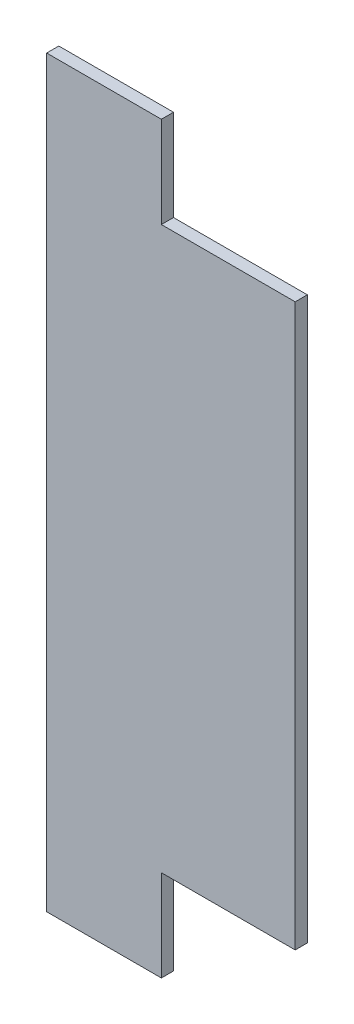
ISO-10303-21;
HEADER;
FILE_DESCRIPTION(('STEP AP214'),'2;1');
FILE_NAME('part.step','',(''),(''),'','','');
FILE_SCHEMA(('AUTOMOTIVE_DESIGN { 1 0 10303 214 1 1 1 1 }'));
ENDSEC;
DATA;
#1=APPLICATION_CONTEXT('core data for automotive mechanical design processes');
#2=APPLICATION_PROTOCOL_DEFINITION('international standard','automotive_design',2000,#1);
#3=PRODUCT_CONTEXT('',#1,'mechanical');
#4=PRODUCT('Part','Part','',(#3));
#5=PRODUCT_RELATED_PRODUCT_CATEGORY('part','',(#4));
#6=PRODUCT_DEFINITION_FORMATION('','',#4);
#7=PRODUCT_DEFINITION_CONTEXT('part definition',#1,'design');
#8=PRODUCT_DEFINITION('design','',#6,#7);
#9=PRODUCT_DEFINITION_SHAPE('','',#8);
#10=(LENGTH_UNIT() NAMED_UNIT(*) SI_UNIT(.MILLI.,.METRE.));
#11=(NAMED_UNIT(*) PLANE_ANGLE_UNIT() SI_UNIT($,.RADIAN.));
#12=(NAMED_UNIT(*) SI_UNIT($,.STERADIAN.) SOLID_ANGLE_UNIT());
#13=UNCERTAINTY_MEASURE_WITH_UNIT(LENGTH_MEASURE(1.E-05),#10,'distance_accuracy_value','');
#14=(GEOMETRIC_REPRESENTATION_CONTEXT(3) GLOBAL_UNCERTAINTY_ASSIGNED_CONTEXT((#13)) GLOBAL_UNIT_ASSIGNED_CONTEXT((#10,
#11,#12)) REPRESENTATION_CONTEXT('',''));
#15=CARTESIAN_POINT('',(0.,0.,0.));
#16=DIRECTION('',(0.,0.,1.));
#17=DIRECTION('',(1.,0.,0.));
#18=AXIS2_PLACEMENT_3D('',#15,#16,#17);
#19=CARTESIAN_POINT('',(15.,97.25,3.175));
#20=DIRECTION('',(-1.,0.,0.));
#21=DIRECTION('',(0.,-1.,0.));
#22=AXIS2_PLACEMENT_3D('',#19,#20,#21);
#23=PLANE('',#22);
#24=DIRECTION('',(0.,0.,1.));
#25=VECTOR('',#24,1.);
#26=CARTESIAN_POINT('',(15.,73.4,-150.914677881245));
#27=LINE('',#26,#25);
#28=CARTESIAN_POINT('',(15.,73.4,0.));
#29=VERTEX_POINT('',#28);
#30=CARTESIAN_POINT('',(15.,73.4,3.175));
#31=VERTEX_POINT('',#30);
#32=EDGE_CURVE('E55',#29,#31,#27,.T.);
#33=ORIENTED_EDGE('',*,*,#32,.F.);
#34=DIRECTION('',(0.,1.,0.));
#35=VECTOR('',#34,1.);
#36=CARTESIAN_POINT('',(15.,97.25,0.));
#37=LINE('',#36,#35);
#38=CARTESIAN_POINT('',(15.,97.25,0.));
#39=VERTEX_POINT('',#38);
#40=EDGE_CURVE('E148',#29,#39,#37,.T.);
#41=ORIENTED_EDGE('',*,*,#40,.T.);
#42=DIRECTION('',(0.,0.,-1.));
#43=VECTOR('',#42,1.);
#44=CARTESIAN_POINT('',(15.,97.25,3.175));
#45=LINE('',#44,#43);
#46=CARTESIAN_POINT('',(15.,97.25,3.175));
#47=VERTEX_POINT('',#46);
#48=EDGE_CURVE('E154',#47,#39,#45,.T.);
#49=ORIENTED_EDGE('',*,*,#48,.F.);
#50=DIRECTION('',(0.,1.,0.));
#51=VECTOR('',#50,1.);
#52=CARTESIAN_POINT('',(15.,97.25,3.175));
#53=LINE('',#52,#51);
#54=EDGE_CURVE('E139',#31,#47,#53,.T.);
#55=ORIENTED_EDGE('',*,*,#54,.F.);
#56=EDGE_LOOP('',(#33,#41,#49,#55));
#57=FACE_BOUND('',#56,.T.);
#58=ADVANCED_FACE('F32',(#57),#23,.F.);
#59=CARTESIAN_POINT('',(-15.,97.25,3.175));
#60=DIRECTION('',(1.,0.,0.));
#61=DIRECTION('',(0.,1.,0.));
#62=AXIS2_PLACEMENT_3D('',#59,#60,#61);
#63=PLANE('',#62);
#64=DIRECTION('',(0.,-1.,0.));
#65=VECTOR('',#64,1.);
#66=CARTESIAN_POINT('',(-15.,97.25,0.));
#67=LINE('',#66,#65);
#68=CARTESIAN_POINT('',(-15.,97.25,0.));
#69=VERTEX_POINT('',#68);
#70=CARTESIAN_POINT('',(-15.,-97.25,0.));
#71=VERTEX_POINT('',#70);
#72=EDGE_CURVE('E133',#69,#71,#67,.T.);
#73=ORIENTED_EDGE('',*,*,#72,.T.);
#74=DIRECTION('',(0.,0.,-1.));
#75=VECTOR('',#74,1.);
#76=CARTESIAN_POINT('',(-15.,-97.25,3.175));
#77=LINE('',#76,#75);
#78=CARTESIAN_POINT('',(-15.,-97.25,3.175));
#79=VERTEX_POINT('',#78);
#80=EDGE_CURVE('E11',#79,#71,#77,.T.);
#81=ORIENTED_EDGE('',*,*,#80,.F.);
#82=DIRECTION('',(0.,-1.,0.));
#83=VECTOR('',#82,1.);
#84=CARTESIAN_POINT('',(-15.,97.25,3.175));
#85=LINE('',#84,#83);
#86=CARTESIAN_POINT('',(-15.,97.25,3.175));
#87=VERTEX_POINT('',#86);
#88=EDGE_CURVE('E134',#87,#79,#85,.T.);
#89=ORIENTED_EDGE('',*,*,#88,.F.);
#90=DIRECTION('',(0.,0.,-1.));
#91=VECTOR('',#90,1.);
#92=CARTESIAN_POINT('',(-15.,97.25,3.175));
#93=LINE('',#92,#91);
#94=EDGE_CURVE('E143',#87,#69,#93,.T.);
#95=ORIENTED_EDGE('',*,*,#94,.T.);
#96=EDGE_LOOP('',(#73,#81,#89,#95));
#97=FACE_BOUND('',#96,.T.);
#98=ADVANCED_FACE('F34',(#97),#63,.F.);
#99=CARTESIAN_POINT('',(-15.,-97.25,3.175));
#100=DIRECTION('',(0.,1.,0.));
#101=DIRECTION('',(0.,0.,1.));
#102=AXIS2_PLACEMENT_3D('',#99,#100,#101);
#103=PLANE('',#102);
#104=DIRECTION('',(1.,0.,0.));
#105=VECTOR('',#104,1.);
#106=CARTESIAN_POINT('',(-15.,-97.25,0.));
#107=LINE('',#106,#105);
#108=CARTESIAN_POINT('',(15.,-97.25,0.));
#109=VERTEX_POINT('',#108);
#110=EDGE_CURVE('E146',#71,#109,#107,.T.);
#111=ORIENTED_EDGE('',*,*,#110,.T.);
#112=DIRECTION('',(0.,0.,-1.));
#113=VECTOR('',#112,1.);
#114=CARTESIAN_POINT('',(15.,-97.25,3.175));
#115=LINE('',#114,#113);
#116=CARTESIAN_POINT('',(15.,-97.25,3.175));
#117=VERTEX_POINT('',#116);
#118=EDGE_CURVE('E40',#117,#109,#115,.T.);
#119=ORIENTED_EDGE('',*,*,#118,.F.);
#120=DIRECTION('',(1.,0.,0.));
#121=VECTOR('',#120,1.);
#122=CARTESIAN_POINT('',(-15.,-97.25,3.175));
#123=LINE('',#122,#121);
#124=EDGE_CURVE('E136',#79,#117,#123,.T.);
#125=ORIENTED_EDGE('',*,*,#124,.F.);
#126=ORIENTED_EDGE('',*,*,#80,.T.);
#127=EDGE_LOOP('',(#111,#119,#125,#126));
#128=FACE_BOUND('',#127,.T.);
#129=ADVANCED_FACE('F176',(#128),#103,.F.);
#130=CARTESIAN_POINT('',(15.,-73.4,0.));
#131=VERTEX_POINT('',#130);
#132=EDGE_CURVE('E149',#109,#131,#37,.T.);
#133=ORIENTED_EDGE('',*,*,#132,.T.);
#134=DIRECTION('',(0.,0.,1.));
#135=VECTOR('',#134,1.);
#136=CARTESIAN_POINT('',(15.,-73.4,-150.914677881245));
#137=LINE('',#136,#135);
#138=CARTESIAN_POINT('',(15.,-73.4,3.175));
#139=VERTEX_POINT('',#138);
#140=EDGE_CURVE('E47',#131,#139,#137,.T.);
#141=ORIENTED_EDGE('',*,*,#140,.T.);
#142=EDGE_CURVE('E121',#117,#139,#53,.T.);
#143=ORIENTED_EDGE('',*,*,#142,.F.);
#144=ORIENTED_EDGE('',*,*,#118,.T.);
#145=EDGE_LOOP('',(#133,#141,#143,#144));
#146=FACE_BOUND('',#145,.T.);
#147=ADVANCED_FACE('F159',(#146),#23,.F.);
#148=CARTESIAN_POINT('',(-15.,97.25,3.175));
#149=DIRECTION('',(0.,-1.,0.));
#150=DIRECTION('',(0.,0.,-1.));
#151=AXIS2_PLACEMENT_3D('',#148,#149,#150);
#152=PLANE('',#151);
#153=DIRECTION('',(-1.,0.,0.));
#154=VECTOR('',#153,1.);
#155=CARTESIAN_POINT('',(-15.,97.25,0.));
#156=LINE('',#155,#154);
#157=EDGE_CURVE('E137',#39,#69,#156,.T.);
#158=ORIENTED_EDGE('',*,*,#157,.T.);
#159=ORIENTED_EDGE('',*,*,#94,.F.);
#160=DIRECTION('',(-1.,0.,0.));
#161=VECTOR('',#160,1.);
#162=CARTESIAN_POINT('',(-15.,97.25,3.175));
#163=LINE('',#162,#161);
#164=EDGE_CURVE('E141',#47,#87,#163,.T.);
#165=ORIENTED_EDGE('',*,*,#164,.F.);
#166=ORIENTED_EDGE('',*,*,#48,.T.);
#167=EDGE_LOOP('',(#158,#159,#165,#166));
#168=FACE_BOUND('',#167,.T.);
#169=ADVANCED_FACE('F172',(#168),#152,.F.);
#170=CARTESIAN_POINT('',(0.,0.,3.175));
#171=DIRECTION('',(0.,0.,1.));
#172=DIRECTION('',(1.,0.,0.));
#173=AXIS2_PLACEMENT_3D('',#170,#171,#172);
#174=PLANE('',#173);
#175=ORIENTED_EDGE('',*,*,#88,.T.);
#176=ORIENTED_EDGE('',*,*,#124,.T.);
#177=ORIENTED_EDGE('',*,*,#142,.T.);
#178=DIRECTION('',(1.,0.,0.));
#179=VECTOR('',#178,1.);
#180=CARTESIAN_POINT('',(15.,-73.4,3.175));
#181=LINE('',#180,#179);
#182=CARTESIAN_POINT('',(50.,-73.4,3.175));
#183=VERTEX_POINT('',#182);
#184=EDGE_CURVE('E103',#139,#183,#181,.T.);
#185=ORIENTED_EDGE('',*,*,#184,.T.);
#186=DIRECTION('',(0.,1.,0.));
#187=VECTOR('',#186,1.);
#188=CARTESIAN_POINT('',(50.,73.4,3.175));
#189=LINE('',#188,#187);
#190=CARTESIAN_POINT('',(50.,73.4,3.175));
#191=VERTEX_POINT('',#190);
#192=EDGE_CURVE('E111',#183,#191,#189,.T.);
#193=ORIENTED_EDGE('',*,*,#192,.T.);
#194=DIRECTION('',(-1.,0.,0.));
#195=VECTOR('',#194,1.);
#196=CARTESIAN_POINT('',(15.,73.4,3.175));
#197=LINE('',#196,#195);
#198=EDGE_CURVE('E117',#191,#31,#197,.T.);
#199=ORIENTED_EDGE('',*,*,#198,.T.);
#200=ORIENTED_EDGE('',*,*,#54,.T.);
#201=ORIENTED_EDGE('',*,*,#164,.T.);
#202=EDGE_LOOP('',(#175,#176,#177,#185,#193,#199,#200,#201));
#203=FACE_BOUND('',#202,.T.);
#204=ADVANCED_FACE('F120',(#203),#174,.T.);
#205=CARTESIAN_POINT('',(0.,0.,0.));
#206=DIRECTION('',(0.,0.,1.));
#207=DIRECTION('',(1.,0.,0.));
#208=AXIS2_PLACEMENT_3D('',#205,#206,#207);
#209=PLANE('',#208);
#210=ORIENTED_EDGE('',*,*,#72,.F.);
#211=ORIENTED_EDGE('',*,*,#157,.F.);
#212=ORIENTED_EDGE('',*,*,#40,.F.);
#213=DIRECTION('',(1.,0.,0.));
#214=VECTOR('',#213,1.);
#215=CARTESIAN_POINT('',(15.,73.4,0.));
#216=LINE('',#215,#214);
#217=CARTESIAN_POINT('',(50.,73.4,0.));
#218=VERTEX_POINT('',#217);
#219=EDGE_CURVE('E124',#29,#218,#216,.T.);
#220=ORIENTED_EDGE('',*,*,#219,.T.);
#221=DIRECTION('',(0.,-1.,0.));
#222=VECTOR('',#221,1.);
#223=CARTESIAN_POINT('',(50.,73.4,0.));
#224=LINE('',#223,#222);
#225=CARTESIAN_POINT('',(50.,-73.4,0.));
#226=VERTEX_POINT('',#225);
#227=EDGE_CURVE('E129',#218,#226,#224,.T.);
#228=ORIENTED_EDGE('',*,*,#227,.T.);
#229=DIRECTION('',(-1.,0.,0.));
#230=VECTOR('',#229,1.);
#231=CARTESIAN_POINT('',(15.,-73.4,0.));
#232=LINE('',#231,#230);
#233=EDGE_CURVE('E105',#226,#131,#232,.T.);
#234=ORIENTED_EDGE('',*,*,#233,.T.);
#235=ORIENTED_EDGE('',*,*,#132,.F.);
#236=ORIENTED_EDGE('',*,*,#110,.F.);
#237=EDGE_LOOP('',(#210,#211,#212,#220,#228,#234,#235,#236));
#238=FACE_BOUND('',#237,.T.);
#239=ADVANCED_FACE('F163',(#238),#209,.F.);
#240=CARTESIAN_POINT('',(15.,73.4,-150.914677881245));
#241=DIRECTION('',(0.,1.,0.));
#242=DIRECTION('',(-1.,0.,0.));
#243=AXIS2_PLACEMENT_3D('',#240,#241,#242);
#244=PLANE('',#243);
#245=ORIENTED_EDGE('',*,*,#219,.F.);
#246=ORIENTED_EDGE('',*,*,#32,.T.);
#247=ORIENTED_EDGE('',*,*,#198,.F.);
#248=DIRECTION('',(0.,0.,1.));
#249=VECTOR('',#248,1.);
#250=CARTESIAN_POINT('',(50.,73.4,-150.914677881245));
#251=LINE('',#250,#249);
#252=EDGE_CURVE('E108',#218,#191,#251,.T.);
#253=ORIENTED_EDGE('',*,*,#252,.F.);
#254=EDGE_LOOP('',(#245,#246,#247,#253));
#255=FACE_BOUND('',#254,.T.);
#256=ADVANCED_FACE('F166',(#255),#244,.T.);
#257=CARTESIAN_POINT('',(50.,73.4,-150.914677881245));
#258=DIRECTION('',(1.,0.,0.));
#259=DIRECTION('',(0.,0.,-1.));
#260=AXIS2_PLACEMENT_3D('',#257,#258,#259);
#261=PLANE('',#260);
#262=ORIENTED_EDGE('',*,*,#227,.F.);
#263=ORIENTED_EDGE('',*,*,#252,.T.);
#264=ORIENTED_EDGE('',*,*,#192,.F.);
#265=DIRECTION('',(0.,0.,1.));
#266=VECTOR('',#265,1.);
#267=CARTESIAN_POINT('',(50.,-73.4,-150.914677881245));
#268=LINE('',#267,#266);
#269=EDGE_CURVE('E99',#226,#183,#268,.T.);
#270=ORIENTED_EDGE('',*,*,#269,.F.);
#271=EDGE_LOOP('',(#262,#263,#264,#270));
#272=FACE_BOUND('',#271,.T.);
#273=ADVANCED_FACE('F112',(#272),#261,.T.);
#274=CARTESIAN_POINT('',(15.,-73.4,-150.914677881245));
#275=DIRECTION('',(0.,-1.,0.));
#276=DIRECTION('',(1.,0.,0.));
#277=AXIS2_PLACEMENT_3D('',#274,#275,#276);
#278=PLANE('',#277);
#279=ORIENTED_EDGE('',*,*,#233,.F.);
#280=ORIENTED_EDGE('',*,*,#269,.T.);
#281=ORIENTED_EDGE('',*,*,#184,.F.);
#282=ORIENTED_EDGE('',*,*,#140,.F.);
#283=EDGE_LOOP('',(#279,#280,#281,#282));
#284=FACE_BOUND('',#283,.T.);
#285=ADVANCED_FACE('F101',(#284),#278,.T.);
#286=CLOSED_SHELL('',(#58,#98,#129,#147,#169,#204,#239,#256,#273,#285));
#287=MANIFOLD_SOLID_BREP('B2',#286);
#288=ADVANCED_BREP_SHAPE_REPRESENTATION('',(#18,#287),#14);
#289=SHAPE_DEFINITION_REPRESENTATION(#9,#288);
ENDSEC;
END-ISO-10303-21;
